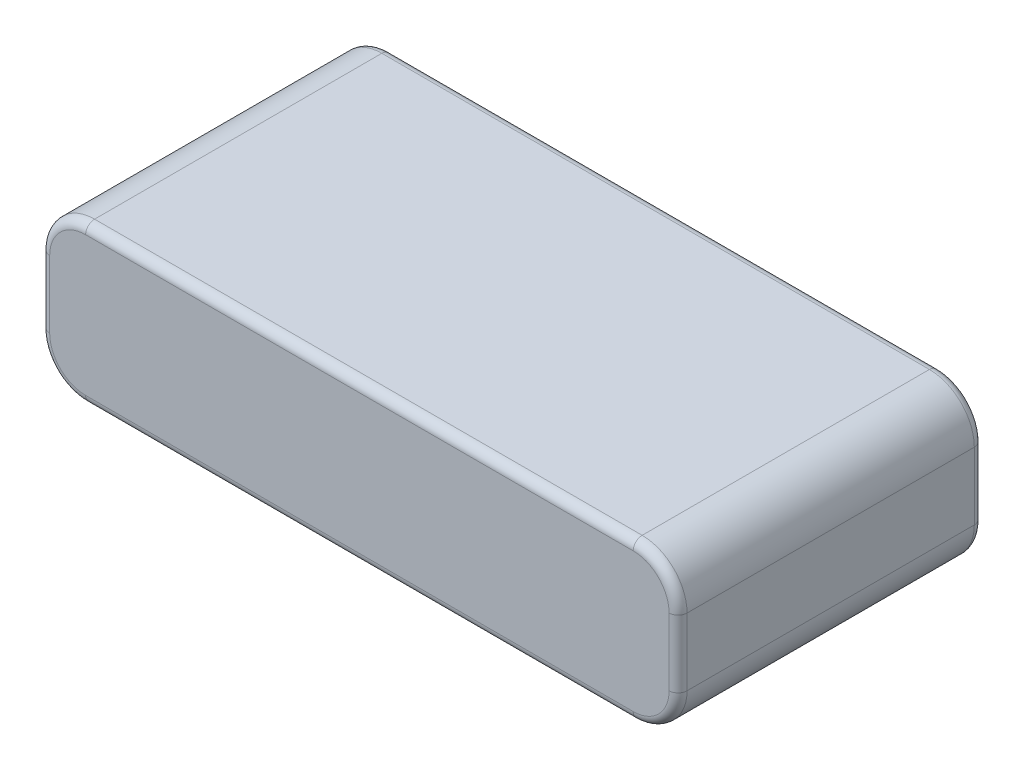
ISO-10303-21;
HEADER;
FILE_DESCRIPTION(('STEP AP214'),'2;1');
FILE_NAME('part.step','',(''),(''),'','','');
FILE_SCHEMA(('AUTOMOTIVE_DESIGN { 1 0 10303 214 1 1 1 1 }'));
ENDSEC;
DATA;
#1=APPLICATION_CONTEXT('core data for automotive mechanical design processes');
#2=APPLICATION_PROTOCOL_DEFINITION('international standard','automotive_design',2000,#1);
#3=PRODUCT_CONTEXT('',#1,'mechanical');
#4=PRODUCT('Part','Part','',(#3));
#5=PRODUCT_RELATED_PRODUCT_CATEGORY('part','',(#4));
#6=PRODUCT_DEFINITION_FORMATION('','',#4);
#7=PRODUCT_DEFINITION_CONTEXT('part definition',#1,'design');
#8=PRODUCT_DEFINITION('design','',#6,#7);
#9=PRODUCT_DEFINITION_SHAPE('','',#8);
#10=(LENGTH_UNIT() NAMED_UNIT(*) SI_UNIT(.MILLI.,.METRE.));
#11=(NAMED_UNIT(*) PLANE_ANGLE_UNIT() SI_UNIT($,.RADIAN.));
#12=(NAMED_UNIT(*) SI_UNIT($,.STERADIAN.) SOLID_ANGLE_UNIT());
#13=UNCERTAINTY_MEASURE_WITH_UNIT(LENGTH_MEASURE(1.E-05),#10,'distance_accuracy_value','');
#14=(GEOMETRIC_REPRESENTATION_CONTEXT(3) GLOBAL_UNCERTAINTY_ASSIGNED_CONTEXT((#13)) GLOBAL_UNIT_ASSIGNED_CONTEXT((#10,
#11,#12)) REPRESENTATION_CONTEXT('',''));
#15=CARTESIAN_POINT('',(0.,0.,0.));
#16=DIRECTION('',(0.,0.,1.));
#17=DIRECTION('',(1.,0.,0.));
#18=AXIS2_PLACEMENT_3D('',#15,#16,#17);
#19=CARTESIAN_POINT('',(35.5,17.5,-17.));
#20=DIRECTION('',(-1.,0.,0.));
#21=DIRECTION('',(0.,0.,1.));
#22=AXIS2_PLACEMENT_3D('',#19,#20,#21);
#23=PLANE('',#22);
#24=DIRECTION('',(0.,0.,-1.));
#25=VECTOR('',#24,1.);
#26=CARTESIAN_POINT('',(35.5,5.,-17.));
#27=LINE('',#26,#25);
#28=CARTESIAN_POINT('',(35.5,5.,16.));
#29=VERTEX_POINT('',#28);
#30=CARTESIAN_POINT('',(35.5,5.,-16.));
#31=VERTEX_POINT('',#30);
#32=EDGE_CURVE('E326',#29,#31,#27,.T.);
#33=ORIENTED_EDGE('',*,*,#32,.T.);
#34=DIRECTION('',(0.,-1.,0.));
#35=VECTOR('',#34,1.);
#36=CARTESIAN_POINT('',(35.5,17.5,-16.));
#37=LINE('',#36,#35);
#38=CARTESIAN_POINT('',(35.5,12.5,-16.));
#39=VERTEX_POINT('',#38);
#40=EDGE_CURVE('E196',#31,#39,#37,.F.);
#41=ORIENTED_EDGE('',*,*,#40,.T.);
#42=DIRECTION('',(0.,0.,-1.));
#43=VECTOR('',#42,1.);
#44=CARTESIAN_POINT('',(35.5,12.5,17.));
#45=LINE('',#44,#43);
#46=CARTESIAN_POINT('',(35.5,12.5,16.));
#47=VERTEX_POINT('',#46);
#48=EDGE_CURVE('E337',#39,#47,#45,.F.);
#49=ORIENTED_EDGE('',*,*,#48,.T.);
#50=DIRECTION('',(0.,-1.,0.));
#51=VECTOR('',#50,1.);
#52=CARTESIAN_POINT('',(35.5,17.5,16.));
#53=LINE('',#52,#51);
#54=EDGE_CURVE('E193',#47,#29,#53,.T.);
#55=ORIENTED_EDGE('',*,*,#54,.T.);
#56=EDGE_LOOP('',(#33,#41,#49,#55));
#57=FACE_BOUND('',#56,.T.);
#58=ADVANCED_FACE('F39',(#57),#23,.F.);
#59=CARTESIAN_POINT('',(-35.5,17.5,-17.));
#60=DIRECTION('',(0.,0.,1.));
#61=DIRECTION('',(1.,0.,0.));
#62=AXIS2_PLACEMENT_3D('',#59,#60,#61);
#63=PLANE('',#62);
#64=DIRECTION('',(0.,-1.,0.));
#65=VECTOR('',#64,1.);
#66=CARTESIAN_POINT('',(34.5,17.5,-17.));
#67=LINE('',#66,#65);
#68=CARTESIAN_POINT('',(34.5,12.5,-17.));
#69=VERTEX_POINT('',#68);
#70=CARTESIAN_POINT('',(34.5,5.,-17.));
#71=VERTEX_POINT('',#70);
#72=EDGE_CURVE('E179',#69,#71,#67,.T.);
#73=ORIENTED_EDGE('',*,*,#72,.T.);
#74=CARTESIAN_POINT('',(30.5,5.,-17.));
#75=DIRECTION('',(0.,0.,1.));
#76=DIRECTION('',(1.,0.,0.));
#77=AXIS2_PLACEMENT_3D('',#74,#75,#76);
#78=CIRCLE('',#77,4.);
#79=CARTESIAN_POINT('',(30.5,1.,-17.));
#80=VERTEX_POINT('',#79);
#81=EDGE_CURVE('E158',#71,#80,#78,.F.);
#82=ORIENTED_EDGE('',*,*,#81,.T.);
#83=DIRECTION('',(-1.,0.,0.));
#84=VECTOR('',#83,1.);
#85=CARTESIAN_POINT('',(-35.5,1.,-17.));
#86=LINE('',#85,#84);
#87=CARTESIAN_POINT('',(-30.5,1.,-17.));
#88=VERTEX_POINT('',#87);
#89=EDGE_CURVE('E167',#80,#88,#86,.T.);
#90=ORIENTED_EDGE('',*,*,#89,.T.);
#91=CARTESIAN_POINT('',(-30.5,5.,-17.));
#92=DIRECTION('',(0.,0.,1.));
#93=DIRECTION('',(1.,0.,0.));
#94=AXIS2_PLACEMENT_3D('',#91,#92,#93);
#95=CIRCLE('',#94,4.);
#96=CARTESIAN_POINT('',(-34.5,5.,-17.));
#97=VERTEX_POINT('',#96);
#98=EDGE_CURVE('E174',#88,#97,#95,.F.);
#99=ORIENTED_EDGE('',*,*,#98,.T.);
#100=DIRECTION('',(0.,-1.,0.));
#101=VECTOR('',#100,1.);
#102=CARTESIAN_POINT('',(-34.5,17.5,-17.));
#103=LINE('',#102,#101);
#104=CARTESIAN_POINT('',(-34.5,12.5,-17.));
#105=VERTEX_POINT('',#104);
#106=EDGE_CURVE('E357',#97,#105,#103,.F.);
#107=ORIENTED_EDGE('',*,*,#106,.T.);
#108=CARTESIAN_POINT('',(-30.5,12.5,-17.));
#109=DIRECTION('',(0.,0.,1.));
#110=DIRECTION('',(1.,0.,0.));
#111=AXIS2_PLACEMENT_3D('',#108,#109,#110);
#112=CIRCLE('',#111,4.);
#113=CARTESIAN_POINT('',(-30.5,16.5,-17.));
#114=VERTEX_POINT('',#113);
#115=EDGE_CURVE('E360',#105,#114,#112,.F.);
#116=ORIENTED_EDGE('',*,*,#115,.T.);
#117=DIRECTION('',(-1.,0.,0.));
#118=VECTOR('',#117,1.);
#119=CARTESIAN_POINT('',(30.5,16.5,-17.));
#120=LINE('',#119,#118);
#121=CARTESIAN_POINT('',(30.5,16.5,-17.));
#122=VERTEX_POINT('',#121);
#123=EDGE_CURVE('E363',#114,#122,#120,.F.);
#124=ORIENTED_EDGE('',*,*,#123,.T.);
#125=CARTESIAN_POINT('',(30.5,12.5,-17.));
#126=DIRECTION('',(0.,0.,1.));
#127=DIRECTION('',(1.,0.,0.));
#128=AXIS2_PLACEMENT_3D('',#125,#126,#127);
#129=CIRCLE('',#128,4.);
#130=EDGE_CURVE('E187',#122,#69,#129,.F.);
#131=ORIENTED_EDGE('',*,*,#130,.T.);
#132=EDGE_LOOP('',(#73,#82,#90,#99,#107,#116,#124,#131));
#133=FACE_BOUND('',#132,.T.);
#134=ADVANCED_FACE('F177',(#133),#63,.F.);
#135=CARTESIAN_POINT('',(-35.5,17.5,-17.));
#136=DIRECTION('',(1.,0.,0.));
#137=DIRECTION('',(0.,0.,-1.));
#138=AXIS2_PLACEMENT_3D('',#135,#136,#137);
#139=PLANE('',#138);
#140=DIRECTION('',(0.,0.,1.));
#141=VECTOR('',#140,1.);
#142=CARTESIAN_POINT('',(-35.5,12.5,-17.));
#143=LINE('',#142,#141);
#144=CARTESIAN_POINT('',(-35.5,12.5,16.));
#145=VERTEX_POINT('',#144);
#146=CARTESIAN_POINT('',(-35.5,12.5,-16.));
#147=VERTEX_POINT('',#146);
#148=EDGE_CURVE('E279',#145,#147,#143,.F.);
#149=ORIENTED_EDGE('',*,*,#148,.T.);
#150=DIRECTION('',(0.,-1.,0.));
#151=VECTOR('',#150,1.);
#152=CARTESIAN_POINT('',(-35.5,17.5,-16.));
#153=LINE('',#152,#151);
#154=CARTESIAN_POINT('',(-35.5,5.,-16.));
#155=VERTEX_POINT('',#154);
#156=EDGE_CURVE('E221',#147,#155,#153,.T.);
#157=ORIENTED_EDGE('',*,*,#156,.T.);
#158=DIRECTION('',(0.,0.,1.));
#159=VECTOR('',#158,1.);
#160=CARTESIAN_POINT('',(-35.5,5.,-17.));
#161=LINE('',#160,#159);
#162=CARTESIAN_POINT('',(-35.5,5.,16.));
#163=VERTEX_POINT('',#162);
#164=EDGE_CURVE('E333',#155,#163,#161,.T.);
#165=ORIENTED_EDGE('',*,*,#164,.T.);
#166=DIRECTION('',(0.,-1.,0.));
#167=VECTOR('',#166,1.);
#168=CARTESIAN_POINT('',(-35.5,17.5,16.));
#169=LINE('',#168,#167);
#170=EDGE_CURVE('E218',#163,#145,#169,.F.);
#171=ORIENTED_EDGE('',*,*,#170,.T.);
#172=EDGE_LOOP('',(#149,#157,#165,#171));
#173=FACE_BOUND('',#172,.T.);
#174=ADVANCED_FACE('F406',(#173),#139,.F.);
#175=CARTESIAN_POINT('',(-35.5,17.5,17.));
#176=DIRECTION('',(0.,0.,-1.));
#177=DIRECTION('',(-1.,0.,0.));
#178=AXIS2_PLACEMENT_3D('',#175,#176,#177);
#179=PLANE('',#178);
#180=DIRECTION('',(1.,0.,0.));
#181=VECTOR('',#180,1.);
#182=CARTESIAN_POINT('',(-30.5,16.5,17.));
#183=LINE('',#182,#181);
#184=CARTESIAN_POINT('',(30.5,16.5,17.));
#185=VERTEX_POINT('',#184);
#186=CARTESIAN_POINT('',(-30.5,16.5,17.));
#187=VERTEX_POINT('',#186);
#188=EDGE_CURVE('E49',#185,#187,#183,.F.);
#189=ORIENTED_EDGE('',*,*,#188,.T.);
#190=CARTESIAN_POINT('',(-30.5,12.5,17.));
#191=DIRECTION('',(0.,0.,-1.));
#192=DIRECTION('',(-1.,0.,0.));
#193=AXIS2_PLACEMENT_3D('',#190,#191,#192);
#194=CIRCLE('',#193,4.);
#195=CARTESIAN_POINT('',(-34.5,12.5,17.));
#196=VERTEX_POINT('',#195);
#197=EDGE_CURVE('E11',#187,#196,#194,.F.);
#198=ORIENTED_EDGE('',*,*,#197,.T.);
#199=DIRECTION('',(0.,-1.,0.));
#200=VECTOR('',#199,1.);
#201=CARTESIAN_POINT('',(-34.5,17.5,17.));
#202=LINE('',#201,#200);
#203=CARTESIAN_POINT('',(-34.5,5.,17.));
#204=VERTEX_POINT('',#203);
#205=EDGE_CURVE('E236',#196,#204,#202,.T.);
#206=ORIENTED_EDGE('',*,*,#205,.T.);
#207=CARTESIAN_POINT('',(-30.5,5.,17.));
#208=DIRECTION('',(0.,0.,-1.));
#209=DIRECTION('',(-1.,0.,0.));
#210=AXIS2_PLACEMENT_3D('',#207,#208,#209);
#211=CIRCLE('',#210,4.);
#212=CARTESIAN_POINT('',(-30.5,1.,17.));
#213=VERTEX_POINT('',#212);
#214=EDGE_CURVE('E239',#204,#213,#211,.F.);
#215=ORIENTED_EDGE('',*,*,#214,.T.);
#216=DIRECTION('',(1.,0.,0.));
#217=VECTOR('',#216,1.);
#218=CARTESIAN_POINT('',(-35.5,1.,17.));
#219=LINE('',#218,#217);
#220=CARTESIAN_POINT('',(30.5,1.,17.));
#221=VERTEX_POINT('',#220);
#222=EDGE_CURVE('E242',#213,#221,#219,.T.);
#223=ORIENTED_EDGE('',*,*,#222,.T.);
#224=CARTESIAN_POINT('',(30.5,5.,17.));
#225=DIRECTION('',(0.,0.,-1.));
#226=DIRECTION('',(-1.,0.,0.));
#227=AXIS2_PLACEMENT_3D('',#224,#225,#226);
#228=CIRCLE('',#227,4.);
#229=CARTESIAN_POINT('',(34.5,5.,17.));
#230=VERTEX_POINT('',#229);
#231=EDGE_CURVE('E245',#221,#230,#228,.F.);
#232=ORIENTED_EDGE('',*,*,#231,.T.);
#233=DIRECTION('',(0.,-1.,0.));
#234=VECTOR('',#233,1.);
#235=CARTESIAN_POINT('',(34.5,17.5,17.));
#236=LINE('',#235,#234);
#237=CARTESIAN_POINT('',(34.5,12.5,17.));
#238=VERTEX_POINT('',#237);
#239=EDGE_CURVE('E248',#230,#238,#236,.F.);
#240=ORIENTED_EDGE('',*,*,#239,.T.);
#241=CARTESIAN_POINT('',(30.5,12.5,17.));
#242=DIRECTION('',(0.,0.,-1.));
#243=DIRECTION('',(-1.,0.,0.));
#244=AXIS2_PLACEMENT_3D('',#241,#242,#243);
#245=CIRCLE('',#244,4.);
#246=EDGE_CURVE('E60',#238,#185,#245,.F.);
#247=ORIENTED_EDGE('',*,*,#246,.T.);
#248=EDGE_LOOP('',(#189,#198,#206,#215,#223,#232,#240,#247));
#249=FACE_BOUND('',#248,.T.);
#250=ADVANCED_FACE('F393',(#249),#179,.F.);
#251=CARTESIAN_POINT('',(0.,17.5,0.));
#252=DIRECTION('',(0.,1.,0.));
#253=DIRECTION('',(0.,0.,1.));
#254=AXIS2_PLACEMENT_3D('',#251,#252,#253);
#255=PLANE('',#254);
#256=DIRECTION('',(0.,0.,-1.));
#257=VECTOR('',#256,1.);
#258=CARTESIAN_POINT('',(30.5,17.5,-17.));
#259=LINE('',#258,#257);
#260=CARTESIAN_POINT('',(30.5,17.5,16.));
#261=VERTEX_POINT('',#260);
#262=CARTESIAN_POINT('',(30.5,17.5,-16.));
#263=VERTEX_POINT('',#262);
#264=EDGE_CURVE('E175',#261,#263,#259,.T.);
#265=ORIENTED_EDGE('',*,*,#264,.T.);
#266=DIRECTION('',(-1.,0.,0.));
#267=VECTOR('',#266,1.);
#268=CARTESIAN_POINT('',(-30.5,17.5,-16.));
#269=LINE('',#268,#267);
#270=CARTESIAN_POINT('',(-30.5,17.5,-16.));
#271=VERTEX_POINT('',#270);
#272=EDGE_CURVE('E208',#263,#271,#269,.T.);
#273=ORIENTED_EDGE('',*,*,#272,.T.);
#274=DIRECTION('',(0.,0.,1.));
#275=VECTOR('',#274,1.);
#276=CARTESIAN_POINT('',(-30.5,17.5,17.));
#277=LINE('',#276,#275);
#278=CARTESIAN_POINT('',(-30.5,17.5,16.));
#279=VERTEX_POINT('',#278);
#280=EDGE_CURVE('E348',#271,#279,#277,.T.);
#281=ORIENTED_EDGE('',*,*,#280,.T.);
#282=DIRECTION('',(1.,0.,0.));
#283=VECTOR('',#282,1.);
#284=CARTESIAN_POINT('',(30.5,17.5,16.));
#285=LINE('',#284,#283);
#286=EDGE_CURVE('E205',#279,#261,#285,.T.);
#287=ORIENTED_EDGE('',*,*,#286,.T.);
#288=EDGE_LOOP('',(#265,#273,#281,#287));
#289=FACE_BOUND('',#288,.T.);
#290=ADVANCED_FACE('F423',(#289),#255,.T.);
#291=CARTESIAN_POINT('',(0.,0.,0.));
#292=DIRECTION('',(0.,1.,0.));
#293=DIRECTION('',(0.,0.,1.));
#294=AXIS2_PLACEMENT_3D('',#291,#292,#293);
#295=PLANE('',#294);
#296=DIRECTION('',(0.,0.,1.));
#297=VECTOR('',#296,1.);
#298=CARTESIAN_POINT('',(-30.5,0.,0.));
#299=LINE('',#298,#297);
#300=CARTESIAN_POINT('',(-30.5,0.,16.));
#301=VERTEX_POINT('',#300);
#302=CARTESIAN_POINT('',(-30.5,0.,-16.));
#303=VERTEX_POINT('',#302);
#304=EDGE_CURVE('E332',#301,#303,#299,.F.);
#305=ORIENTED_EDGE('',*,*,#304,.T.);
#306=DIRECTION('',(-1.,0.,0.));
#307=VECTOR('',#306,1.);
#308=CARTESIAN_POINT('',(0.,0.,-16.));
#309=LINE('',#308,#307);
#310=CARTESIAN_POINT('',(30.5,0.,-16.));
#311=VERTEX_POINT('',#310);
#312=EDGE_CURVE('E233',#303,#311,#309,.F.);
#313=ORIENTED_EDGE('',*,*,#312,.T.);
#314=DIRECTION('',(0.,0.,-1.));
#315=VECTOR('',#314,1.);
#316=CARTESIAN_POINT('',(30.5,0.,0.));
#317=LINE('',#316,#315);
#318=CARTESIAN_POINT('',(30.5,0.,16.));
#319=VERTEX_POINT('',#318);
#320=EDGE_CURVE('E324',#311,#319,#317,.F.);
#321=ORIENTED_EDGE('',*,*,#320,.T.);
#322=DIRECTION('',(1.,0.,0.));
#323=VECTOR('',#322,1.);
#324=CARTESIAN_POINT('',(0.,0.,16.));
#325=LINE('',#324,#323);
#326=EDGE_CURVE('E230',#319,#301,#325,.F.);
#327=ORIENTED_EDGE('',*,*,#326,.T.);
#328=EDGE_LOOP('',(#305,#313,#321,#327));
#329=FACE_BOUND('',#328,.T.);
#330=ADVANCED_FACE('F329',(#329),#295,.F.);
#331=CARTESIAN_POINT('',(-30.5,5.,-17.));
#332=DIRECTION('',(0.,0.,1.));
#333=DIRECTION('',(1.,0.,0.));
#334=AXIS2_PLACEMENT_3D('',#331,#332,#333);
#335=CYLINDRICAL_SURFACE('',#334,5.);
#336=ORIENTED_EDGE('',*,*,#164,.F.);
#337=CARTESIAN_POINT('',(-30.5,5.,-16.));
#338=DIRECTION('',(0.,0.,1.));
#339=DIRECTION('',(1.,0.,0.));
#340=AXIS2_PLACEMENT_3D('',#337,#338,#339);
#341=CIRCLE('',#340,5.);
#342=EDGE_CURVE('E227',#155,#303,#341,.T.);
#343=ORIENTED_EDGE('',*,*,#342,.T.);
#344=ORIENTED_EDGE('',*,*,#304,.F.);
#345=CARTESIAN_POINT('',(-30.5,5.,16.));
#346=DIRECTION('',(0.,0.,-1.));
#347=DIRECTION('',(-1.,0.,0.));
#348=AXIS2_PLACEMENT_3D('',#345,#346,#347);
#349=CIRCLE('',#348,5.);
#350=EDGE_CURVE('E224',#301,#163,#349,.T.);
#351=ORIENTED_EDGE('',*,*,#350,.T.);
#352=EDGE_LOOP('',(#336,#343,#344,#351));
#353=FACE_BOUND('',#352,.T.);
#354=ADVANCED_FACE('F430',(#353),#335,.T.);
#355=CARTESIAN_POINT('',(30.5,5.,-17.));
#356=DIRECTION('',(0.,0.,-1.));
#357=DIRECTION('',(-1.,0.,0.));
#358=AXIS2_PLACEMENT_3D('',#355,#356,#357);
#359=CYLINDRICAL_SURFACE('',#358,5.);
#360=ORIENTED_EDGE('',*,*,#320,.F.);
#361=CARTESIAN_POINT('',(30.5,5.,-16.));
#362=DIRECTION('',(0.,0.,1.));
#363=DIRECTION('',(1.,0.,0.));
#364=AXIS2_PLACEMENT_3D('',#361,#362,#363);
#365=CIRCLE('',#364,5.);
#366=EDGE_CURVE('E160',#311,#31,#365,.T.);
#367=ORIENTED_EDGE('',*,*,#366,.T.);
#368=ORIENTED_EDGE('',*,*,#32,.F.);
#369=CARTESIAN_POINT('',(30.5,5.,16.));
#370=DIRECTION('',(0.,0.,-1.));
#371=DIRECTION('',(-1.,0.,0.));
#372=AXIS2_PLACEMENT_3D('',#369,#370,#371);
#373=CIRCLE('',#372,5.);
#374=EDGE_CURVE('E182',#29,#319,#373,.T.);
#375=ORIENTED_EDGE('',*,*,#374,.T.);
#376=EDGE_LOOP('',(#360,#367,#368,#375));
#377=FACE_BOUND('',#376,.T.);
#378=ADVANCED_FACE('F323',(#377),#359,.T.);
#379=CARTESIAN_POINT('',(30.5,12.5,0.));
#380=DIRECTION('',(0.,0.,1.));
#381=DIRECTION('',(1.,0.,0.));
#382=AXIS2_PLACEMENT_3D('',#379,#380,#381);
#383=CYLINDRICAL_SURFACE('',#382,5.);
#384=ORIENTED_EDGE('',*,*,#48,.F.);
#385=CARTESIAN_POINT('',(30.5,12.5,-16.));
#386=DIRECTION('',(0.,0.,1.));
#387=DIRECTION('',(1.,0.,0.));
#388=AXIS2_PLACEMENT_3D('',#385,#386,#387);
#389=CIRCLE('',#388,5.);
#390=EDGE_CURVE('E202',#39,#263,#389,.T.);
#391=ORIENTED_EDGE('',*,*,#390,.T.);
#392=ORIENTED_EDGE('',*,*,#264,.F.);
#393=CARTESIAN_POINT('',(30.5,12.5,16.));
#394=DIRECTION('',(0.,0.,-1.));
#395=DIRECTION('',(-1.,0.,0.));
#396=AXIS2_PLACEMENT_3D('',#393,#394,#395);
#397=CIRCLE('',#396,5.);
#398=EDGE_CURVE('E199',#261,#47,#397,.T.);
#399=ORIENTED_EDGE('',*,*,#398,.T.);
#400=EDGE_LOOP('',(#384,#391,#392,#399));
#401=FACE_BOUND('',#400,.T.);
#402=ADVANCED_FACE('F379',(#401),#383,.T.);
#403=CARTESIAN_POINT('',(-30.5,12.5,0.));
#404=DIRECTION('',(0.,0.,-1.));
#405=DIRECTION('',(-1.,0.,0.));
#406=AXIS2_PLACEMENT_3D('',#403,#404,#405);
#407=CYLINDRICAL_SURFACE('',#406,5.);
#408=ORIENTED_EDGE('',*,*,#280,.F.);
#409=CARTESIAN_POINT('',(-30.5,12.5,-16.));
#410=DIRECTION('',(0.,0.,1.));
#411=DIRECTION('',(1.,0.,0.));
#412=AXIS2_PLACEMENT_3D('',#409,#410,#411);
#413=CIRCLE('',#412,5.);
#414=EDGE_CURVE('E215',#271,#147,#413,.T.);
#415=ORIENTED_EDGE('',*,*,#414,.T.);
#416=ORIENTED_EDGE('',*,*,#148,.F.);
#417=CARTESIAN_POINT('',(-30.5,12.5,16.));
#418=DIRECTION('',(0.,0.,-1.));
#419=DIRECTION('',(-1.,0.,0.));
#420=AXIS2_PLACEMENT_3D('',#417,#418,#419);
#421=CIRCLE('',#420,5.);
#422=EDGE_CURVE('E211',#145,#279,#421,.T.);
#423=ORIENTED_EDGE('',*,*,#422,.T.);
#424=EDGE_LOOP('',(#408,#415,#416,#423));
#425=FACE_BOUND('',#424,.T.);
#426=ADVANCED_FACE('F411',(#425),#407,.T.);
#427=CARTESIAN_POINT('',(-30.5,12.5,-16.));
#428=DIRECTION('',(0.,0.,1.));
#429=DIRECTION('',(1.,0.,0.));
#430=AXIS2_PLACEMENT_3D('',#427,#428,#429);
#431=TOROIDAL_SURFACE('',#430,4.,1.);
#432=CARTESIAN_POINT('',(-34.5,12.5,-16.));
#433=DIRECTION('',(0.,-1.,0.));
#434=DIRECTION('',(0.,0.,-1.));
#435=AXIS2_PLACEMENT_3D('',#432,#433,#434);
#436=CIRCLE('',#435,1.);
#437=EDGE_CURVE('E271',#147,#105,#436,.T.);
#438=ORIENTED_EDGE('',*,*,#437,.F.);
#439=ORIENTED_EDGE('',*,*,#414,.F.);
#440=CARTESIAN_POINT('',(-30.5,16.5,-16.));
#441=DIRECTION('',(1.,0.,0.));
#442=DIRECTION('',(0.,0.,-1.));
#443=AXIS2_PLACEMENT_3D('',#440,#441,#442);
#444=CIRCLE('',#443,1.);
#445=EDGE_CURVE('E275',#114,#271,#444,.T.);
#446=ORIENTED_EDGE('',*,*,#445,.F.);
#447=ORIENTED_EDGE('',*,*,#115,.F.);
#448=EDGE_LOOP('',(#438,#439,#446,#447));
#449=FACE_BOUND('',#448,.T.);
#450=ADVANCED_FACE('F416',(#449),#431,.T.);
#451=CARTESIAN_POINT('',(0.,16.5,-16.));
#452=DIRECTION('',(1.,0.,0.));
#453=DIRECTION('',(0.,0.,-1.));
#454=AXIS2_PLACEMENT_3D('',#451,#452,#453);
#455=CYLINDRICAL_SURFACE('',#454,1.);
#456=ORIENTED_EDGE('',*,*,#445,.T.);
#457=ORIENTED_EDGE('',*,*,#272,.F.);
#458=CARTESIAN_POINT('',(30.5,16.5,-16.));
#459=DIRECTION('',(1.,0.,0.));
#460=DIRECTION('',(0.,0.,-1.));
#461=AXIS2_PLACEMENT_3D('',#458,#459,#460);
#462=CIRCLE('',#461,1.);
#463=EDGE_CURVE('E267',#122,#263,#462,.T.);
#464=ORIENTED_EDGE('',*,*,#463,.F.);
#465=ORIENTED_EDGE('',*,*,#123,.F.);
#466=EDGE_LOOP('',(#456,#457,#464,#465));
#467=FACE_BOUND('',#466,.T.);
#468=ADVANCED_FACE('F421',(#467),#455,.T.);
#469=CARTESIAN_POINT('',(-34.5,17.5,-16.));
#470=DIRECTION('',(0.,-1.,0.));
#471=DIRECTION('',(0.,0.,-1.));
#472=AXIS2_PLACEMENT_3D('',#469,#470,#471);
#473=CYLINDRICAL_SURFACE('',#472,1.);
#474=ORIENTED_EDGE('',*,*,#437,.T.);
#475=ORIENTED_EDGE('',*,*,#106,.F.);
#476=CARTESIAN_POINT('',(-34.5,5.,-16.));
#477=DIRECTION('',(0.,-1.,0.));
#478=DIRECTION('',(0.,0.,-1.));
#479=AXIS2_PLACEMENT_3D('',#476,#477,#478);
#480=CIRCLE('',#479,1.);
#481=EDGE_CURVE('E263',#155,#97,#480,.T.);
#482=ORIENTED_EDGE('',*,*,#481,.F.);
#483=ORIENTED_EDGE('',*,*,#156,.F.);
#484=EDGE_LOOP('',(#474,#475,#482,#483));
#485=FACE_BOUND('',#484,.T.);
#486=ADVANCED_FACE('F462',(#485),#473,.T.);
#487=CARTESIAN_POINT('',(30.5,12.5,-16.));
#488=DIRECTION('',(0.,0.,1.));
#489=DIRECTION('',(1.,0.,0.));
#490=AXIS2_PLACEMENT_3D('',#487,#488,#489);
#491=TOROIDAL_SURFACE('',#490,4.,1.);
#492=ORIENTED_EDGE('',*,*,#463,.T.);
#493=ORIENTED_EDGE('',*,*,#390,.F.);
#494=CARTESIAN_POINT('',(34.5,12.5,-16.));
#495=DIRECTION('',(0.,-1.,0.));
#496=DIRECTION('',(0.,0.,-1.));
#497=AXIS2_PLACEMENT_3D('',#494,#495,#496);
#498=CIRCLE('',#497,1.);
#499=EDGE_CURVE('E259',#69,#39,#498,.T.);
#500=ORIENTED_EDGE('',*,*,#499,.F.);
#501=ORIENTED_EDGE('',*,*,#130,.F.);
#502=EDGE_LOOP('',(#492,#493,#500,#501));
#503=FACE_BOUND('',#502,.T.);
#504=ADVANCED_FACE('F372',(#503),#491,.T.);
#505=CARTESIAN_POINT('',(-30.5,5.,-16.));
#506=DIRECTION('',(0.,0.,1.));
#507=DIRECTION('',(1.,0.,0.));
#508=AXIS2_PLACEMENT_3D('',#505,#506,#507);
#509=TOROIDAL_SURFACE('',#508,4.,1.);
#510=ORIENTED_EDGE('',*,*,#481,.T.);
#511=ORIENTED_EDGE('',*,*,#98,.F.);
#512=CARTESIAN_POINT('',(-30.5,1.,-16.));
#513=DIRECTION('',(1.,0.,0.));
#514=DIRECTION('',(0.,0.,-1.));
#515=AXIS2_PLACEMENT_3D('',#512,#513,#514);
#516=CIRCLE('',#515,1.);
#517=EDGE_CURVE('E170',#303,#88,#516,.T.);
#518=ORIENTED_EDGE('',*,*,#517,.F.);
#519=ORIENTED_EDGE('',*,*,#342,.F.);
#520=EDGE_LOOP('',(#510,#511,#518,#519));
#521=FACE_BOUND('',#520,.T.);
#522=ADVANCED_FACE('F456',(#521),#509,.T.);
#523=CARTESIAN_POINT('',(34.5,17.5,-16.));
#524=DIRECTION('',(0.,-1.,0.));
#525=DIRECTION('',(0.,0.,-1.));
#526=AXIS2_PLACEMENT_3D('',#523,#524,#525);
#527=CYLINDRICAL_SURFACE('',#526,1.);
#528=ORIENTED_EDGE('',*,*,#499,.T.);
#529=ORIENTED_EDGE('',*,*,#40,.F.);
#530=CARTESIAN_POINT('',(34.5,5.,-16.));
#531=DIRECTION('',(0.,-1.,0.));
#532=DIRECTION('',(0.,0.,-1.));
#533=AXIS2_PLACEMENT_3D('',#530,#531,#532);
#534=CIRCLE('',#533,1.);
#535=EDGE_CURVE('E164',#71,#31,#534,.T.);
#536=ORIENTED_EDGE('',*,*,#535,.F.);
#537=ORIENTED_EDGE('',*,*,#72,.F.);
#538=EDGE_LOOP('',(#528,#529,#536,#537));
#539=FACE_BOUND('',#538,.T.);
#540=ADVANCED_FACE('F375',(#539),#527,.T.);
#541=CARTESIAN_POINT('',(-35.5,1.,-16.));
#542=DIRECTION('',(-1.,0.,0.));
#543=DIRECTION('',(0.,0.,1.));
#544=AXIS2_PLACEMENT_3D('',#541,#542,#543);
#545=CYLINDRICAL_SURFACE('',#544,1.);
#546=ORIENTED_EDGE('',*,*,#517,.T.);
#547=ORIENTED_EDGE('',*,*,#89,.F.);
#548=CARTESIAN_POINT('',(30.5,1.,-16.));
#549=DIRECTION('',(1.,0.,0.));
#550=DIRECTION('',(0.,0.,-1.));
#551=AXIS2_PLACEMENT_3D('',#548,#549,#550);
#552=CIRCLE('',#551,1.);
#553=EDGE_CURVE('E154',#311,#80,#552,.T.);
#554=ORIENTED_EDGE('',*,*,#553,.F.);
#555=ORIENTED_EDGE('',*,*,#312,.F.);
#556=EDGE_LOOP('',(#546,#547,#554,#555));
#557=FACE_BOUND('',#556,.T.);
#558=ADVANCED_FACE('F168',(#557),#545,.T.);
#559=CARTESIAN_POINT('',(30.5,5.,-16.));
#560=DIRECTION('',(0.,0.,1.));
#561=DIRECTION('',(1.,0.,0.));
#562=AXIS2_PLACEMENT_3D('',#559,#560,#561);
#563=TOROIDAL_SURFACE('',#562,4.,1.);
#564=ORIENTED_EDGE('',*,*,#535,.T.);
#565=ORIENTED_EDGE('',*,*,#366,.F.);
#566=ORIENTED_EDGE('',*,*,#553,.T.);
#567=ORIENTED_EDGE('',*,*,#81,.F.);
#568=EDGE_LOOP('',(#564,#565,#566,#567));
#569=FACE_BOUND('',#568,.T.);
#570=ADVANCED_FACE('F156',(#569),#563,.T.);
#571=CARTESIAN_POINT('',(30.5,5.,16.));
#572=DIRECTION('',(0.,0.,-1.));
#573=DIRECTION('',(-1.,0.,0.));
#574=AXIS2_PLACEMENT_3D('',#571,#572,#573);
#575=TOROIDAL_SURFACE('',#574,4.,1.);
#576=CARTESIAN_POINT('',(30.5,1.,16.));
#577=DIRECTION('',(-1.,0.,0.));
#578=DIRECTION('',(0.,0.,1.));
#579=AXIS2_PLACEMENT_3D('',#576,#577,#578);
#580=CIRCLE('',#579,1.);
#581=EDGE_CURVE('E301',#319,#221,#580,.T.);
#582=ORIENTED_EDGE('',*,*,#581,.F.);
#583=ORIENTED_EDGE('',*,*,#374,.F.);
#584=CARTESIAN_POINT('',(34.5,5.,16.));
#585=DIRECTION('',(0.,1.,0.));
#586=DIRECTION('',(0.,0.,1.));
#587=AXIS2_PLACEMENT_3D('',#584,#585,#586);
#588=CIRCLE('',#587,1.);
#589=EDGE_CURVE('E43',#230,#29,#588,.T.);
#590=ORIENTED_EDGE('',*,*,#589,.F.);
#591=ORIENTED_EDGE('',*,*,#231,.F.);
#592=EDGE_LOOP('',(#582,#583,#590,#591));
#593=FACE_BOUND('',#592,.T.);
#594=ADVANCED_FACE('F41',(#593),#575,.T.);
#595=CARTESIAN_POINT('',(34.5,17.5,16.));
#596=DIRECTION('',(0.,-1.,0.));
#597=DIRECTION('',(0.,0.,-1.));
#598=AXIS2_PLACEMENT_3D('',#595,#596,#597);
#599=CYLINDRICAL_SURFACE('',#598,1.);
#600=ORIENTED_EDGE('',*,*,#589,.T.);
#601=ORIENTED_EDGE('',*,*,#54,.F.);
#602=CARTESIAN_POINT('',(34.5,12.5,16.));
#603=DIRECTION('',(0.,1.,0.));
#604=DIRECTION('',(0.,0.,1.));
#605=AXIS2_PLACEMENT_3D('',#602,#603,#604);
#606=CIRCLE('',#605,1.);
#607=EDGE_CURVE('E298',#238,#47,#606,.T.);
#608=ORIENTED_EDGE('',*,*,#607,.F.);
#609=ORIENTED_EDGE('',*,*,#239,.F.);
#610=EDGE_LOOP('',(#600,#601,#608,#609));
#611=FACE_BOUND('',#610,.T.);
#612=ADVANCED_FACE('F314',(#611),#599,.T.);
#613=CARTESIAN_POINT('',(-35.5,1.,16.));
#614=DIRECTION('',(1.,0.,0.));
#615=DIRECTION('',(0.,0.,-1.));
#616=AXIS2_PLACEMENT_3D('',#613,#614,#615);
#617=CYLINDRICAL_SURFACE('',#616,1.);
#618=ORIENTED_EDGE('',*,*,#581,.T.);
#619=ORIENTED_EDGE('',*,*,#222,.F.);
#620=CARTESIAN_POINT('',(-30.5,1.,16.));
#621=DIRECTION('',(-1.,0.,0.));
#622=DIRECTION('',(0.,0.,1.));
#623=AXIS2_PLACEMENT_3D('',#620,#621,#622);
#624=CIRCLE('',#623,1.);
#625=EDGE_CURVE('E294',#301,#213,#624,.T.);
#626=ORIENTED_EDGE('',*,*,#625,.F.);
#627=ORIENTED_EDGE('',*,*,#326,.F.);
#628=EDGE_LOOP('',(#618,#619,#626,#627));
#629=FACE_BOUND('',#628,.T.);
#630=ADVANCED_FACE('F480',(#629),#617,.T.);
#631=CARTESIAN_POINT('',(30.5,12.5,16.));
#632=DIRECTION('',(0.,0.,-1.));
#633=DIRECTION('',(-1.,0.,0.));
#634=AXIS2_PLACEMENT_3D('',#631,#632,#633);
#635=TOROIDAL_SURFACE('',#634,4.,1.);
#636=ORIENTED_EDGE('',*,*,#607,.T.);
#637=ORIENTED_EDGE('',*,*,#398,.F.);
#638=CARTESIAN_POINT('',(30.5,16.5,16.));
#639=DIRECTION('',(-1.,0.,0.));
#640=DIRECTION('',(0.,0.,1.));
#641=AXIS2_PLACEMENT_3D('',#638,#639,#640);
#642=CIRCLE('',#641,1.);
#643=EDGE_CURVE('E290',#185,#261,#642,.T.);
#644=ORIENTED_EDGE('',*,*,#643,.F.);
#645=ORIENTED_EDGE('',*,*,#246,.F.);
#646=EDGE_LOOP('',(#636,#637,#644,#645));
#647=FACE_BOUND('',#646,.T.);
#648=ADVANCED_FACE('F383',(#647),#635,.T.);
#649=CARTESIAN_POINT('',(-30.5,5.,16.));
#650=DIRECTION('',(0.,0.,-1.));
#651=DIRECTION('',(-1.,0.,0.));
#652=AXIS2_PLACEMENT_3D('',#649,#650,#651);
#653=TOROIDAL_SURFACE('',#652,4.,1.);
#654=ORIENTED_EDGE('',*,*,#625,.T.);
#655=ORIENTED_EDGE('',*,*,#214,.F.);
#656=CARTESIAN_POINT('',(-34.5,5.,16.));
#657=DIRECTION('',(0.,1.,0.));
#658=DIRECTION('',(0.,0.,1.));
#659=AXIS2_PLACEMENT_3D('',#656,#657,#658);
#660=CIRCLE('',#659,1.);
#661=EDGE_CURVE('E286',#163,#204,#660,.T.);
#662=ORIENTED_EDGE('',*,*,#661,.F.);
#663=ORIENTED_EDGE('',*,*,#350,.F.);
#664=EDGE_LOOP('',(#654,#655,#662,#663));
#665=FACE_BOUND('',#664,.T.);
#666=ADVANCED_FACE('F398',(#665),#653,.T.);
#667=CARTESIAN_POINT('',(0.,16.5,16.));
#668=DIRECTION('',(-1.,0.,0.));
#669=DIRECTION('',(0.,0.,1.));
#670=AXIS2_PLACEMENT_3D('',#667,#668,#669);
#671=CYLINDRICAL_SURFACE('',#670,1.);
#672=ORIENTED_EDGE('',*,*,#643,.T.);
#673=ORIENTED_EDGE('',*,*,#286,.F.);
#674=CARTESIAN_POINT('',(-30.5,16.5,16.));
#675=DIRECTION('',(-1.,0.,0.));
#676=DIRECTION('',(0.,0.,1.));
#677=AXIS2_PLACEMENT_3D('',#674,#675,#676);
#678=CIRCLE('',#677,1.);
#679=EDGE_CURVE('E283',#187,#279,#678,.T.);
#680=ORIENTED_EDGE('',*,*,#679,.F.);
#681=ORIENTED_EDGE('',*,*,#188,.F.);
#682=EDGE_LOOP('',(#672,#673,#680,#681));
#683=FACE_BOUND('',#682,.T.);
#684=ADVANCED_FACE('F386',(#683),#671,.T.);
#685=CARTESIAN_POINT('',(-34.5,17.5,16.));
#686=DIRECTION('',(0.,-1.,0.));
#687=DIRECTION('',(0.,0.,-1.));
#688=AXIS2_PLACEMENT_3D('',#685,#686,#687);
#689=CYLINDRICAL_SURFACE('',#688,1.);
#690=ORIENTED_EDGE('',*,*,#661,.T.);
#691=ORIENTED_EDGE('',*,*,#205,.F.);
#692=CARTESIAN_POINT('',(-34.5,12.5,16.));
#693=DIRECTION('',(0.,1.,0.));
#694=DIRECTION('',(0.,0.,1.));
#695=AXIS2_PLACEMENT_3D('',#692,#693,#694);
#696=CIRCLE('',#695,1.);
#697=EDGE_CURVE('E280',#145,#196,#696,.T.);
#698=ORIENTED_EDGE('',*,*,#697,.F.);
#699=ORIENTED_EDGE('',*,*,#170,.F.);
#700=EDGE_LOOP('',(#690,#691,#698,#699));
#701=FACE_BOUND('',#700,.T.);
#702=ADVANCED_FACE('F402',(#701),#689,.T.);
#703=CARTESIAN_POINT('',(-30.5,12.5,16.));
#704=DIRECTION('',(0.,0.,-1.));
#705=DIRECTION('',(-1.,0.,0.));
#706=AXIS2_PLACEMENT_3D('',#703,#704,#705);
#707=TOROIDAL_SURFACE('',#706,4.,1.);
#708=ORIENTED_EDGE('',*,*,#679,.T.);
#709=ORIENTED_EDGE('',*,*,#422,.F.);
#710=ORIENTED_EDGE('',*,*,#697,.T.);
#711=ORIENTED_EDGE('',*,*,#197,.F.);
#712=EDGE_LOOP('',(#708,#709,#710,#711));
#713=FACE_BOUND('',#712,.T.);
#714=ADVANCED_FACE('F390',(#713),#707,.T.);
#715=CLOSED_SHELL('',(#58,#134,#174,#250,#290,#330,#354,#378,#402,#426,#450,#468,#486,#504,#522,
#540,#558,#570,#594,#612,#630,#648,#666,#684,#702,#714));
#716=MANIFOLD_SOLID_BREP('B2',#715);
#717=ADVANCED_BREP_SHAPE_REPRESENTATION('',(#18,#716),#14);
#718=SHAPE_DEFINITION_REPRESENTATION(#9,#717);
ENDSEC;
END-ISO-10303-21;
